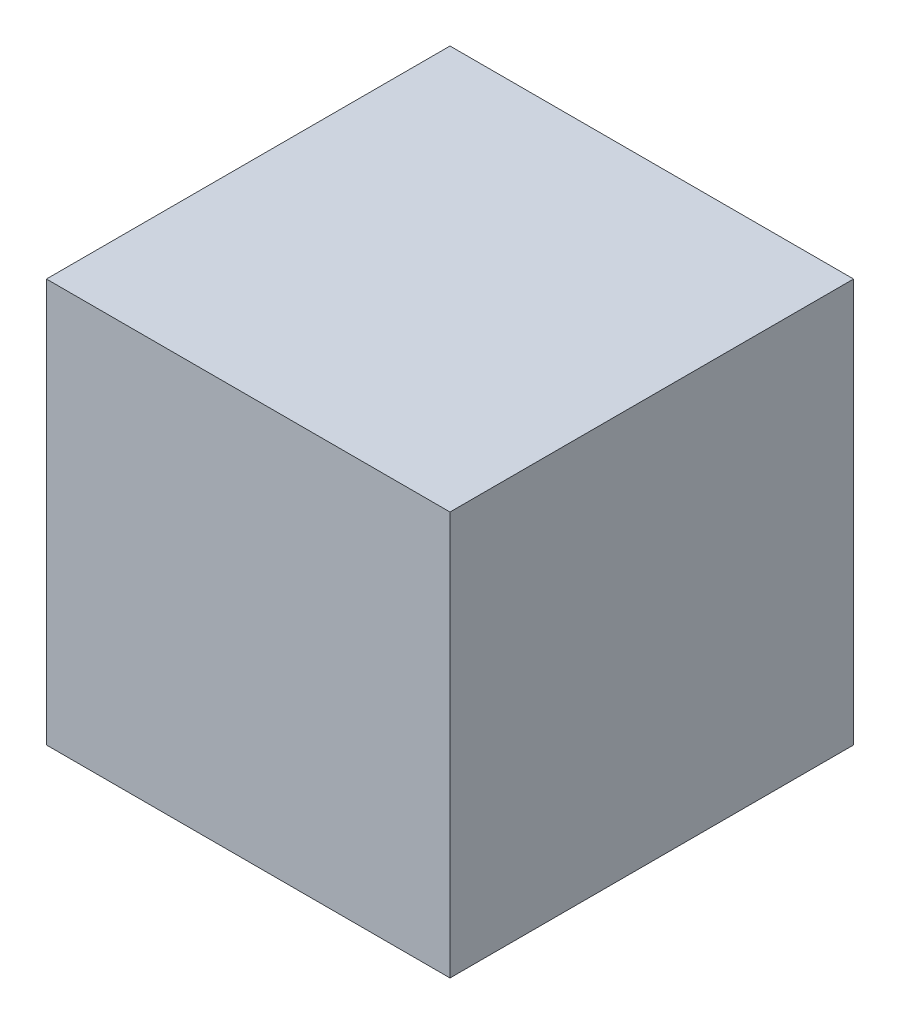
ISO-10303-21;
HEADER;
FILE_DESCRIPTION(('STEP AP214'),'2;1');
FILE_NAME('part.step','',(''),(''),'','','');
FILE_SCHEMA(('AUTOMOTIVE_DESIGN { 1 0 10303 214 1 1 1 1 }'));
ENDSEC;
DATA;
#1=APPLICATION_CONTEXT('core data for automotive mechanical design processes');
#2=APPLICATION_PROTOCOL_DEFINITION('international standard','automotive_design',2000,#1);
#3=PRODUCT_CONTEXT('',#1,'mechanical');
#4=PRODUCT('Part','Part','',(#3));
#5=PRODUCT_RELATED_PRODUCT_CATEGORY('part','',(#4));
#6=PRODUCT_DEFINITION_FORMATION('','',#4);
#7=PRODUCT_DEFINITION_CONTEXT('part definition',#1,'design');
#8=PRODUCT_DEFINITION('design','',#6,#7);
#9=PRODUCT_DEFINITION_SHAPE('','',#8);
#10=(LENGTH_UNIT() NAMED_UNIT(*) SI_UNIT(.MILLI.,.METRE.));
#11=(NAMED_UNIT(*) PLANE_ANGLE_UNIT() SI_UNIT($,.RADIAN.));
#12=(NAMED_UNIT(*) SI_UNIT($,.STERADIAN.) SOLID_ANGLE_UNIT());
#13=UNCERTAINTY_MEASURE_WITH_UNIT(LENGTH_MEASURE(1.E-05),#10,'distance_accuracy_value','');
#14=(GEOMETRIC_REPRESENTATION_CONTEXT(3) GLOBAL_UNCERTAINTY_ASSIGNED_CONTEXT((#13)) GLOBAL_UNIT_ASSIGNED_CONTEXT((#10,
#11,#12)) REPRESENTATION_CONTEXT('',''));
#15=CARTESIAN_POINT('',(0.,0.,0.));
#16=DIRECTION('',(0.,0.,1.));
#17=DIRECTION('',(1.,0.,0.));
#18=AXIS2_PLACEMENT_3D('',#15,#16,#17);
#19=CARTESIAN_POINT('',(28.5,-28.5,57.));
#20=DIRECTION('',(-1.,0.,0.));
#21=DIRECTION('',(0.,0.,1.));
#22=AXIS2_PLACEMENT_3D('',#19,#20,#21);
#23=PLANE('',#22);
#24=DIRECTION('',(0.,1.,0.));
#25=VECTOR('',#24,1.);
#26=CARTESIAN_POINT('',(28.5,-28.5,0.));
#27=LINE('',#26,#25);
#28=CARTESIAN_POINT('',(28.5,-28.5,0.));
#29=VERTEX_POINT('',#28);
#30=CARTESIAN_POINT('',(28.5,28.5,0.));
#31=VERTEX_POINT('',#30);
#32=EDGE_CURVE('E98',#29,#31,#27,.T.);
#33=ORIENTED_EDGE('',*,*,#32,.T.);
#34=DIRECTION('',(0.,0.,-1.));
#35=VECTOR('',#34,1.);
#36=CARTESIAN_POINT('',(28.5,28.5,57.));
#37=LINE('',#36,#35);
#38=CARTESIAN_POINT('',(28.5,28.5,57.));
#39=VERTEX_POINT('',#38);
#40=EDGE_CURVE('E11',#39,#31,#37,.T.);
#41=ORIENTED_EDGE('',*,*,#40,.F.);
#42=DIRECTION('',(0.,1.,0.));
#43=VECTOR('',#42,1.);
#44=CARTESIAN_POINT('',(28.5,-28.5,57.));
#45=LINE('',#44,#43);
#46=CARTESIAN_POINT('',(28.5,-28.5,57.));
#47=VERTEX_POINT('',#46);
#48=EDGE_CURVE('E86',#47,#39,#45,.T.);
#49=ORIENTED_EDGE('',*,*,#48,.F.);
#50=DIRECTION('',(0.,0.,-1.));
#51=VECTOR('',#50,1.);
#52=CARTESIAN_POINT('',(28.5,-28.5,57.));
#53=LINE('',#52,#51);
#54=EDGE_CURVE('E94',#47,#29,#53,.T.);
#55=ORIENTED_EDGE('',*,*,#54,.T.);
#56=EDGE_LOOP('',(#33,#41,#49,#55));
#57=FACE_BOUND('',#56,.T.);
#58=ADVANCED_FACE('F35',(#57),#23,.F.);
#59=CARTESIAN_POINT('',(-28.5,28.5,57.));
#60=DIRECTION('',(0.,-1.,0.));
#61=DIRECTION('',(0.,0.,-1.));
#62=AXIS2_PLACEMENT_3D('',#59,#60,#61);
#63=PLANE('',#62);
#64=DIRECTION('',(-1.,0.,0.));
#65=VECTOR('',#64,1.);
#66=CARTESIAN_POINT('',(-28.5,28.5,0.));
#67=LINE('',#66,#65);
#68=CARTESIAN_POINT('',(-28.5,28.5,0.));
#69=VERTEX_POINT('',#68);
#70=EDGE_CURVE('E90',#31,#69,#67,.T.);
#71=ORIENTED_EDGE('',*,*,#70,.T.);
#72=DIRECTION('',(0.,0.,-1.));
#73=VECTOR('',#72,1.);
#74=CARTESIAN_POINT('',(-28.5,28.5,57.));
#75=LINE('',#74,#73);
#76=CARTESIAN_POINT('',(-28.5,28.5,57.));
#77=VERTEX_POINT('',#76);
#78=EDGE_CURVE('E43',#77,#69,#75,.T.);
#79=ORIENTED_EDGE('',*,*,#78,.F.);
#80=DIRECTION('',(-1.,0.,0.));
#81=VECTOR('',#80,1.);
#82=CARTESIAN_POINT('',(-28.5,28.5,57.));
#83=LINE('',#82,#81);
#84=EDGE_CURVE('E81',#39,#77,#83,.T.);
#85=ORIENTED_EDGE('',*,*,#84,.F.);
#86=ORIENTED_EDGE('',*,*,#40,.T.);
#87=EDGE_LOOP('',(#71,#79,#85,#86));
#88=FACE_BOUND('',#87,.T.);
#89=ADVANCED_FACE('F89',(#88),#63,.F.);
#90=CARTESIAN_POINT('',(-28.5,-28.5,57.));
#91=DIRECTION('',(1.,0.,0.));
#92=DIRECTION('',(0.,0.,-1.));
#93=AXIS2_PLACEMENT_3D('',#90,#91,#92);
#94=PLANE('',#93);
#95=DIRECTION('',(0.,-1.,0.));
#96=VECTOR('',#95,1.);
#97=CARTESIAN_POINT('',(-28.5,-28.5,0.));
#98=LINE('',#97,#96);
#99=CARTESIAN_POINT('',(-28.5,-28.5,0.));
#100=VERTEX_POINT('',#99);
#101=EDGE_CURVE('E68',#69,#100,#98,.T.);
#102=ORIENTED_EDGE('',*,*,#101,.T.);
#103=DIRECTION('',(0.,0.,-1.));
#104=VECTOR('',#103,1.);
#105=CARTESIAN_POINT('',(-28.5,-28.5,57.));
#106=LINE('',#105,#104);
#107=CARTESIAN_POINT('',(-28.5,-28.5,57.));
#108=VERTEX_POINT('',#107);
#109=EDGE_CURVE('E91',#108,#100,#106,.T.);
#110=ORIENTED_EDGE('',*,*,#109,.F.);
#111=DIRECTION('',(0.,-1.,0.));
#112=VECTOR('',#111,1.);
#113=CARTESIAN_POINT('',(-28.5,-28.5,57.));
#114=LINE('',#113,#112);
#115=EDGE_CURVE('E84',#77,#108,#114,.T.);
#116=ORIENTED_EDGE('',*,*,#115,.F.);
#117=ORIENTED_EDGE('',*,*,#78,.T.);
#118=EDGE_LOOP('',(#102,#110,#116,#117));
#119=FACE_BOUND('',#118,.T.);
#120=ADVANCED_FACE('F92',(#119),#94,.F.);
#121=CARTESIAN_POINT('',(-28.5,-28.5,57.));
#122=DIRECTION('',(0.,1.,0.));
#123=DIRECTION('',(0.,0.,1.));
#124=AXIS2_PLACEMENT_3D('',#121,#122,#123);
#125=PLANE('',#124);
#126=DIRECTION('',(1.,0.,0.));
#127=VECTOR('',#126,1.);
#128=CARTESIAN_POINT('',(-28.5,-28.5,0.));
#129=LINE('',#128,#127);
#130=EDGE_CURVE('E74',#100,#29,#129,.T.);
#131=ORIENTED_EDGE('',*,*,#130,.T.);
#132=ORIENTED_EDGE('',*,*,#54,.F.);
#133=DIRECTION('',(1.,0.,0.));
#134=VECTOR('',#133,1.);
#135=CARTESIAN_POINT('',(-28.5,-28.5,57.));
#136=LINE('',#135,#134);
#137=EDGE_CURVE('E51',#108,#47,#136,.T.);
#138=ORIENTED_EDGE('',*,*,#137,.F.);
#139=ORIENTED_EDGE('',*,*,#109,.T.);
#140=EDGE_LOOP('',(#131,#132,#138,#139));
#141=FACE_BOUND('',#140,.T.);
#142=ADVANCED_FACE('F105',(#141),#125,.F.);
#143=CARTESIAN_POINT('',(0.,0.,57.));
#144=DIRECTION('',(0.,0.,-1.));
#145=DIRECTION('',(-1.,0.,0.));
#146=AXIS2_PLACEMENT_3D('',#143,#144,#145);
#147=PLANE('',#146);
#148=ORIENTED_EDGE('',*,*,#48,.T.);
#149=ORIENTED_EDGE('',*,*,#84,.T.);
#150=ORIENTED_EDGE('',*,*,#115,.T.);
#151=ORIENTED_EDGE('',*,*,#137,.T.);
#152=EDGE_LOOP('',(#148,#149,#150,#151));
#153=FACE_BOUND('',#152,.T.);
#154=ADVANCED_FACE('F82',(#153),#147,.F.);
#155=CARTESIAN_POINT('',(0.,0.,0.));
#156=DIRECTION('',(0.,0.,-1.));
#157=DIRECTION('',(-1.,0.,0.));
#158=AXIS2_PLACEMENT_3D('',#155,#156,#157);
#159=PLANE('',#158);
#160=ORIENTED_EDGE('',*,*,#32,.F.);
#161=ORIENTED_EDGE('',*,*,#130,.F.);
#162=ORIENTED_EDGE('',*,*,#101,.F.);
#163=ORIENTED_EDGE('',*,*,#70,.F.);
#164=EDGE_LOOP('',(#160,#161,#162,#163));
#165=FACE_BOUND('',#164,.T.);
#166=ADVANCED_FACE('F108',(#165),#159,.T.);
#167=CLOSED_SHELL('',(#58,#89,#120,#142,#154,#166));
#168=MANIFOLD_SOLID_BREP('B2',#167);
#169=ADVANCED_BREP_SHAPE_REPRESENTATION('',(#18,#168),#14);
#170=SHAPE_DEFINITION_REPRESENTATION(#9,#169);
ENDSEC;
END-ISO-10303-21;
